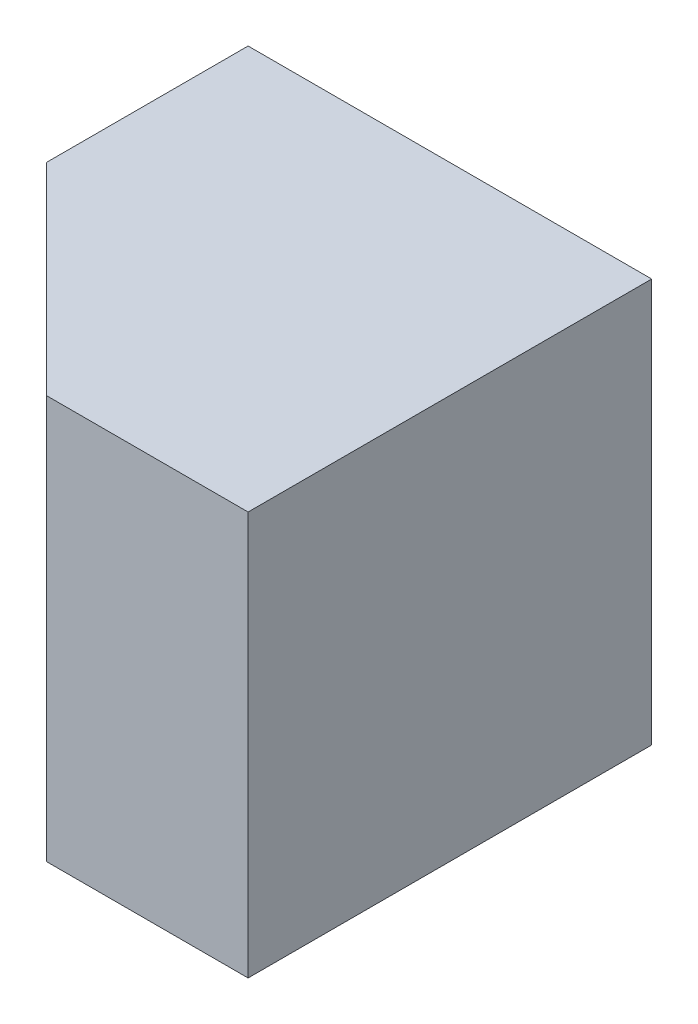
ISO-10303-21;
HEADER;
FILE_DESCRIPTION(('STEP AP214'),'2;1');
FILE_NAME('part.step','',(''),(''),'','','');
FILE_SCHEMA(('AUTOMOTIVE_DESIGN { 1 0 10303 214 1 1 1 1 }'));
ENDSEC;
DATA;
#1=APPLICATION_CONTEXT('core data for automotive mechanical design processes');
#2=APPLICATION_PROTOCOL_DEFINITION('international standard','automotive_design',2000,#1);
#3=PRODUCT_CONTEXT('',#1,'mechanical');
#4=PRODUCT('Part','Part','',(#3));
#5=PRODUCT_RELATED_PRODUCT_CATEGORY('part','',(#4));
#6=PRODUCT_DEFINITION_FORMATION('','',#4);
#7=PRODUCT_DEFINITION_CONTEXT('part definition',#1,'design');
#8=PRODUCT_DEFINITION('design','',#6,#7);
#9=PRODUCT_DEFINITION_SHAPE('','',#8);
#10=(LENGTH_UNIT() NAMED_UNIT(*) SI_UNIT(.MILLI.,.METRE.));
#11=(NAMED_UNIT(*) PLANE_ANGLE_UNIT() SI_UNIT($,.RADIAN.));
#12=(NAMED_UNIT(*) SI_UNIT($,.STERADIAN.) SOLID_ANGLE_UNIT());
#13=UNCERTAINTY_MEASURE_WITH_UNIT(LENGTH_MEASURE(1.E-05),#10,'distance_accuracy_value','');
#14=(GEOMETRIC_REPRESENTATION_CONTEXT(3) GLOBAL_UNCERTAINTY_ASSIGNED_CONTEXT((#13)) GLOBAL_UNIT_ASSIGNED_CONTEXT((#10,
#11,#12)) REPRESENTATION_CONTEXT('',''));
#15=CARTESIAN_POINT('',(0.,0.,0.));
#16=DIRECTION('',(0.,0.,1.));
#17=DIRECTION('',(1.,0.,0.));
#18=AXIS2_PLACEMENT_3D('',#15,#16,#17);
#19=CARTESIAN_POINT('',(0.,0.,20.));
#20=DIRECTION('',(1.,0.,0.));
#21=DIRECTION('',(0.,0.,-1.));
#22=AXIS2_PLACEMENT_3D('',#19,#20,#21);
#23=PLANE('',#22);
#24=DIRECTION('',(0.,0.,-1.));
#25=VECTOR('',#24,1.);
#26=CARTESIAN_POINT('',(0.,0.,20.));
#27=LINE('',#26,#25);
#28=CARTESIAN_POINT('',(0.,0.,10.));
#29=VERTEX_POINT('',#28);
#30=CARTESIAN_POINT('',(0.,0.,0.));
#31=VERTEX_POINT('',#30);
#32=EDGE_CURVE('E11',#29,#31,#27,.T.);
#33=ORIENTED_EDGE('',*,*,#32,.F.);
#34=DIRECTION('',(0.,1.,0.));
#35=VECTOR('',#34,1.);
#36=CARTESIAN_POINT('',(0.,0.,10.));
#37=LINE('',#36,#35);
#38=CARTESIAN_POINT('',(0.,20.,10.));
#39=VERTEX_POINT('',#38);
#40=EDGE_CURVE('E81',#29,#39,#37,.T.);
#41=ORIENTED_EDGE('',*,*,#40,.T.);
#42=DIRECTION('',(0.,0.,-1.));
#43=VECTOR('',#42,1.);
#44=CARTESIAN_POINT('',(0.,20.,20.));
#45=LINE('',#44,#43);
#46=CARTESIAN_POINT('',(0.,20.,0.));
#47=VERTEX_POINT('',#46);
#48=EDGE_CURVE('E75',#39,#47,#45,.T.);
#49=ORIENTED_EDGE('',*,*,#48,.T.);
#50=DIRECTION('',(0.,-1.,0.));
#51=VECTOR('',#50,1.);
#52=CARTESIAN_POINT('',(0.,0.,0.));
#53=LINE('',#52,#51);
#54=EDGE_CURVE('E79',#47,#31,#53,.T.);
#55=ORIENTED_EDGE('',*,*,#54,.T.);
#56=EDGE_LOOP('',(#33,#41,#49,#55));
#57=FACE_BOUND('',#56,.T.);
#58=ADVANCED_FACE('F33',(#57),#23,.F.);
#59=CARTESIAN_POINT('',(0.,0.,20.));
#60=DIRECTION('',(0.,1.,0.));
#61=DIRECTION('',(0.,0.,1.));
#62=AXIS2_PLACEMENT_3D('',#59,#60,#61);
#63=PLANE('',#62);
#64=DIRECTION('',(1.,0.,0.));
#65=VECTOR('',#64,1.);
#66=CARTESIAN_POINT('',(0.,0.,20.));
#67=LINE('',#66,#65);
#68=CARTESIAN_POINT('',(10.,0.,20.));
#69=VERTEX_POINT('',#68);
#70=CARTESIAN_POINT('',(20.,0.,20.));
#71=VERTEX_POINT('',#70);
#72=EDGE_CURVE('E94',#69,#71,#67,.T.);
#73=ORIENTED_EDGE('',*,*,#72,.F.);
#74=DIRECTION('',(-0.707106781186548,0.,-0.707106781186548));
#75=VECTOR('',#74,1.);
#76=CARTESIAN_POINT('',(0.,0.,10.));
#77=LINE('',#76,#75);
#78=EDGE_CURVE('E47',#69,#29,#77,.T.);
#79=ORIENTED_EDGE('',*,*,#78,.T.);
#80=ORIENTED_EDGE('',*,*,#32,.T.);
#81=DIRECTION('',(1.,0.,0.));
#82=VECTOR('',#81,1.);
#83=CARTESIAN_POINT('',(0.,0.,0.));
#84=LINE('',#83,#82);
#85=CARTESIAN_POINT('',(20.,0.,0.));
#86=VERTEX_POINT('',#85);
#87=EDGE_CURVE('E99',#31,#86,#84,.T.);
#88=ORIENTED_EDGE('',*,*,#87,.T.);
#89=DIRECTION('',(0.,0.,-1.));
#90=VECTOR('',#89,1.);
#91=CARTESIAN_POINT('',(20.,0.,20.));
#92=LINE('',#91,#90);
#93=EDGE_CURVE('E40',#71,#86,#92,.T.);
#94=ORIENTED_EDGE('',*,*,#93,.F.);
#95=EDGE_LOOP('',(#73,#79,#80,#88,#94));
#96=FACE_BOUND('',#95,.T.);
#97=ADVANCED_FACE('F114',(#96),#63,.F.);
#98=CARTESIAN_POINT('',(20.,0.,20.));
#99=DIRECTION('',(-1.,0.,0.));
#100=DIRECTION('',(0.,0.,1.));
#101=AXIS2_PLACEMENT_3D('',#98,#99,#100);
#102=PLANE('',#101);
#103=DIRECTION('',(0.,1.,0.));
#104=VECTOR('',#103,1.);
#105=CARTESIAN_POINT('',(20.,0.,0.));
#106=LINE('',#105,#104);
#107=CARTESIAN_POINT('',(20.,20.,0.));
#108=VERTEX_POINT('',#107);
#109=EDGE_CURVE('E95',#86,#108,#106,.T.);
#110=ORIENTED_EDGE('',*,*,#109,.T.);
#111=DIRECTION('',(0.,0.,-1.));
#112=VECTOR('',#111,1.);
#113=CARTESIAN_POINT('',(20.,20.,20.));
#114=LINE('',#113,#112);
#115=CARTESIAN_POINT('',(20.,20.,20.));
#116=VERTEX_POINT('',#115);
#117=EDGE_CURVE('E84',#116,#108,#114,.T.);
#118=ORIENTED_EDGE('',*,*,#117,.F.);
#119=DIRECTION('',(0.,1.,0.));
#120=VECTOR('',#119,1.);
#121=CARTESIAN_POINT('',(20.,0.,20.));
#122=LINE('',#121,#120);
#123=EDGE_CURVE('E56',#71,#116,#122,.T.);
#124=ORIENTED_EDGE('',*,*,#123,.F.);
#125=ORIENTED_EDGE('',*,*,#93,.T.);
#126=EDGE_LOOP('',(#110,#118,#124,#125));
#127=FACE_BOUND('',#126,.T.);
#128=ADVANCED_FACE('F111',(#127),#102,.F.);
#129=CARTESIAN_POINT('',(0.,20.,20.));
#130=DIRECTION('',(0.,-1.,0.));
#131=DIRECTION('',(0.,0.,-1.));
#132=AXIS2_PLACEMENT_3D('',#129,#130,#131);
#133=PLANE('',#132);
#134=ORIENTED_EDGE('',*,*,#48,.F.);
#135=DIRECTION('',(-0.707106781186548,0.,-0.707106781186548));
#136=VECTOR('',#135,1.);
#137=CARTESIAN_POINT('',(0.,20.,10.));
#138=LINE('',#137,#136);
#139=CARTESIAN_POINT('',(10.,20.,20.));
#140=VERTEX_POINT('',#139);
#141=EDGE_CURVE('E120',#140,#39,#138,.T.);
#142=ORIENTED_EDGE('',*,*,#141,.F.);
#143=DIRECTION('',(-1.,0.,0.));
#144=VECTOR('',#143,1.);
#145=CARTESIAN_POINT('',(0.,20.,20.));
#146=LINE('',#145,#144);
#147=EDGE_CURVE('E85',#116,#140,#146,.T.);
#148=ORIENTED_EDGE('',*,*,#147,.F.);
#149=ORIENTED_EDGE('',*,*,#117,.T.);
#150=DIRECTION('',(-1.,0.,0.));
#151=VECTOR('',#150,1.);
#152=CARTESIAN_POINT('',(0.,20.,0.));
#153=LINE('',#152,#151);
#154=EDGE_CURVE('E89',#108,#47,#153,.T.);
#155=ORIENTED_EDGE('',*,*,#154,.T.);
#156=EDGE_LOOP('',(#134,#142,#148,#149,#155));
#157=FACE_BOUND('',#156,.T.);
#158=ADVANCED_FACE('F90',(#157),#133,.F.);
#159=CARTESIAN_POINT('',(0.,0.,20.));
#160=DIRECTION('',(0.,0.,-1.));
#161=DIRECTION('',(-1.,0.,0.));
#162=AXIS2_PLACEMENT_3D('',#159,#160,#161);
#163=PLANE('',#162);
#164=ORIENTED_EDGE('',*,*,#147,.T.);
#165=DIRECTION('',(0.,1.,0.));
#166=VECTOR('',#165,1.);
#167=CARTESIAN_POINT('',(10.,0.,20.));
#168=LINE('',#167,#166);
#169=EDGE_CURVE('E102',#69,#140,#168,.T.);
#170=ORIENTED_EDGE('',*,*,#169,.F.);
#171=ORIENTED_EDGE('',*,*,#72,.T.);
#172=ORIENTED_EDGE('',*,*,#123,.T.);
#173=EDGE_LOOP('',(#164,#170,#171,#172));
#174=FACE_BOUND('',#173,.T.);
#175=ADVANCED_FACE('F123',(#174),#163,.F.);
#176=CARTESIAN_POINT('',(0.,0.,0.));
#177=DIRECTION('',(0.,0.,-1.));
#178=DIRECTION('',(-1.,0.,0.));
#179=AXIS2_PLACEMENT_3D('',#176,#177,#178);
#180=PLANE('',#179);
#181=ORIENTED_EDGE('',*,*,#54,.F.);
#182=ORIENTED_EDGE('',*,*,#154,.F.);
#183=ORIENTED_EDGE('',*,*,#109,.F.);
#184=ORIENTED_EDGE('',*,*,#87,.F.);
#185=EDGE_LOOP('',(#181,#182,#183,#184));
#186=FACE_BOUND('',#185,.T.);
#187=ADVANCED_FACE('F98',(#186),#180,.T.);
#188=CARTESIAN_POINT('',(0.,0.,10.));
#189=DIRECTION('',(0.707106781186548,0.,-0.707106781186548));
#190=DIRECTION('',(-0.707106781186548,0.,-0.707106781186548));
#191=AXIS2_PLACEMENT_3D('',#188,#189,#190);
#192=PLANE('',#191);
#193=ORIENTED_EDGE('',*,*,#141,.T.);
#194=ORIENTED_EDGE('',*,*,#40,.F.);
#195=ORIENTED_EDGE('',*,*,#78,.F.);
#196=ORIENTED_EDGE('',*,*,#169,.T.);
#197=EDGE_LOOP('',(#193,#194,#195,#196));
#198=FACE_BOUND('',#197,.T.);
#199=ADVANCED_FACE('F119',(#198),#192,.F.);
#200=CLOSED_SHELL('',(#58,#97,#128,#158,#175,#187,#199));
#201=MANIFOLD_SOLID_BREP('B2',#200);
#202=ADVANCED_BREP_SHAPE_REPRESENTATION('',(#18,#201),#14);
#203=SHAPE_DEFINITION_REPRESENTATION(#9,#202);
ENDSEC;
END-ISO-10303-21;
